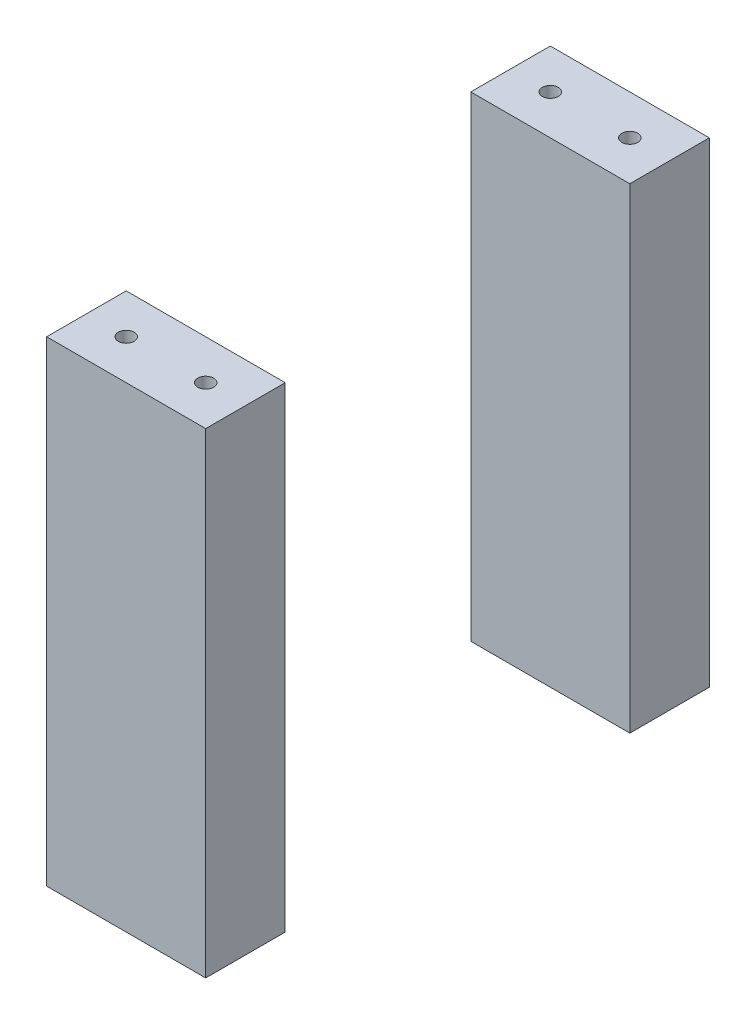
ISO-10303-21;
HEADER;
FILE_DESCRIPTION(('STEP AP214'),'2;1');
FILE_NAME('part.step','',(''),(''),'','','');
FILE_SCHEMA(('AUTOMOTIVE_DESIGN { 1 0 10303 214 1 1 1 1 }'));
ENDSEC;
DATA;
#1=APPLICATION_CONTEXT('core data for automotive mechanical design processes');
#2=APPLICATION_PROTOCOL_DEFINITION('international standard','automotive_design',2000,#1);
#3=PRODUCT_CONTEXT('',#1,'mechanical');
#4=PRODUCT('Part','Part','',(#3));
#5=PRODUCT_RELATED_PRODUCT_CATEGORY('part','',(#4));
#6=PRODUCT_DEFINITION_FORMATION('','',#4);
#7=PRODUCT_DEFINITION_CONTEXT('part definition',#1,'design');
#8=PRODUCT_DEFINITION('design','',#6,#7);
#9=PRODUCT_DEFINITION_SHAPE('','',#8);
#10=(LENGTH_UNIT() NAMED_UNIT(*) SI_UNIT(.MILLI.,.METRE.));
#11=(NAMED_UNIT(*) PLANE_ANGLE_UNIT() SI_UNIT($,.RADIAN.));
#12=(NAMED_UNIT(*) SI_UNIT($,.STERADIAN.) SOLID_ANGLE_UNIT());
#13=UNCERTAINTY_MEASURE_WITH_UNIT(LENGTH_MEASURE(1.E-05),#10,'distance_accuracy_value','');
#14=(GEOMETRIC_REPRESENTATION_CONTEXT(3) GLOBAL_UNCERTAINTY_ASSIGNED_CONTEXT((#13)) GLOBAL_UNIT_ASSIGNED_CONTEXT((#10,
#11,#12)) REPRESENTATION_CONTEXT('',''));
#15=CARTESIAN_POINT('',(0.,0.,0.));
#16=DIRECTION('',(0.,0.,1.));
#17=DIRECTION('',(1.,0.,0.));
#18=AXIS2_PLACEMENT_3D('',#15,#16,#17);
#19=CARTESIAN_POINT('',(0.,163.5,0.));
#20=DIRECTION('',(0.,1.,0.));
#21=DIRECTION('',(0.,0.,1.));
#22=AXIS2_PLACEMENT_3D('',#19,#20,#21);
#23=PLANE('',#22);
#24=CARTESIAN_POINT('',(14.9999999999996,163.5,270.));
#25=DIRECTION('',(0.,1.,0.));
#26=DIRECTION('',(0.,0.,1.));
#27=AXIS2_PLACEMENT_3D('',#24,#25,#26);
#28=CIRCLE('',#27,3.00000000000001);
#29=CARTESIAN_POINT('',(14.9999999999996,163.5,273.));
#30=VERTEX_POINT('',#29);
#31=EDGE_CURVE('E113',#30,#30,#28,.T.);
#32=ORIENTED_EDGE('',*,*,#31,.F.);
#33=EDGE_LOOP('',(#32));
#34=FACE_BOUND('',#33,.T.);
#35=DIRECTION('',(0.,0.,1.));
#36=VECTOR('',#35,1.);
#37=CARTESIAN_POINT('',(-30.0000000000004,163.5,255.));
#38=LINE('',#37,#36);
#39=CARTESIAN_POINT('',(-30.0000000000004,163.5,255.));
#40=VERTEX_POINT('',#39);
#41=CARTESIAN_POINT('',(-30.0000000000004,163.5,285.));
#42=VERTEX_POINT('',#41);
#43=EDGE_CURVE('E97',#40,#42,#38,.T.);
#44=ORIENTED_EDGE('',*,*,#43,.T.);
#45=DIRECTION('',(1.,0.,0.));
#46=VECTOR('',#45,1.);
#47=CARTESIAN_POINT('',(-30.0000000000004,163.5,285.));
#48=LINE('',#47,#46);
#49=CARTESIAN_POINT('',(29.9999999999997,163.5,285.));
#50=VERTEX_POINT('',#49);
#51=EDGE_CURVE('E114',#42,#50,#48,.T.);
#52=ORIENTED_EDGE('',*,*,#51,.T.);
#53=DIRECTION('',(0.,0.,-1.));
#54=VECTOR('',#53,1.);
#55=CARTESIAN_POINT('',(29.9999999999997,163.5,255.));
#56=LINE('',#55,#54);
#57=CARTESIAN_POINT('',(29.9999999999997,163.5,255.));
#58=VERTEX_POINT('',#57);
#59=EDGE_CURVE('E98',#50,#58,#56,.T.);
#60=ORIENTED_EDGE('',*,*,#59,.T.);
#61=DIRECTION('',(-1.,0.,0.));
#62=VECTOR('',#61,1.);
#63=CARTESIAN_POINT('',(-30.0000000000004,163.5,255.));
#64=LINE('',#63,#62);
#65=EDGE_CURVE('E93',#58,#40,#64,.T.);
#66=ORIENTED_EDGE('',*,*,#65,.T.);
#67=EDGE_LOOP('',(#44,#52,#60,#66));
#68=FACE_BOUND('',#67,.T.);
#69=CARTESIAN_POINT('',(-14.9999999999996,163.5,270.));
#70=DIRECTION('',(0.,1.,0.));
#71=DIRECTION('',(0.,0.,1.));
#72=AXIS2_PLACEMENT_3D('',#69,#70,#71);
#73=CIRCLE('',#72,3.00000000000018);
#74=CARTESIAN_POINT('',(-14.9999999999996,163.5,273.));
#75=VERTEX_POINT('',#74);
#76=EDGE_CURVE('E117',#75,#75,#73,.T.);
#77=ORIENTED_EDGE('',*,*,#76,.F.);
#78=EDGE_LOOP('',(#77));
#79=FACE_BOUND('',#78,.T.);
#80=ADVANCED_FACE('F49',(#34,#68,#79),#23,.T.);
#81=CARTESIAN_POINT('',(-30.0000000000004,163.5,255.));
#82=DIRECTION('',(1.,0.,0.));
#83=DIRECTION('',(0.,0.,-1.));
#84=AXIS2_PLACEMENT_3D('',#81,#82,#83);
#85=PLANE('',#84);
#86=DIRECTION('',(0.,-1.,0.));
#87=VECTOR('',#86,1.);
#88=CARTESIAN_POINT('',(-30.0000000000004,163.5,255.));
#89=LINE('',#88,#87);
#90=CARTESIAN_POINT('',(-30.0000000000004,-16.,255.));
#91=VERTEX_POINT('',#90);
#92=EDGE_CURVE('E101',#40,#91,#89,.T.);
#93=ORIENTED_EDGE('',*,*,#92,.T.);
#94=DIRECTION('',(0.,0.,1.));
#95=VECTOR('',#94,1.);
#96=CARTESIAN_POINT('',(-30.0000000000004,-16.,255.));
#97=LINE('',#96,#95);
#98=CARTESIAN_POINT('',(-30.0000000000004,-16.,285.));
#99=VERTEX_POINT('',#98);
#100=EDGE_CURVE('E129',#91,#99,#97,.T.);
#101=ORIENTED_EDGE('',*,*,#100,.T.);
#102=DIRECTION('',(0.,-1.,0.));
#103=VECTOR('',#102,1.);
#104=CARTESIAN_POINT('',(-30.0000000000004,163.5,285.));
#105=LINE('',#104,#103);
#106=EDGE_CURVE('E64',#42,#99,#105,.T.);
#107=ORIENTED_EDGE('',*,*,#106,.F.);
#108=ORIENTED_EDGE('',*,*,#43,.F.);
#109=EDGE_LOOP('',(#93,#101,#107,#108));
#110=FACE_BOUND('',#109,.T.);
#111=ADVANCED_FACE('F112',(#110),#85,.F.);
#112=CARTESIAN_POINT('',(-30.0000000000004,163.5,285.));
#113=DIRECTION('',(0.,0.,-1.));
#114=DIRECTION('',(-1.,0.,0.));
#115=AXIS2_PLACEMENT_3D('',#112,#113,#114);
#116=PLANE('',#115);
#117=ORIENTED_EDGE('',*,*,#106,.T.);
#118=DIRECTION('',(1.,0.,0.));
#119=VECTOR('',#118,1.);
#120=CARTESIAN_POINT('',(-30.0000000000004,-16.,285.));
#121=LINE('',#120,#119);
#122=CARTESIAN_POINT('',(29.9999999999997,-16.,285.));
#123=VERTEX_POINT('',#122);
#124=EDGE_CURVE('E127',#99,#123,#121,.T.);
#125=ORIENTED_EDGE('',*,*,#124,.T.);
#126=DIRECTION('',(0.,-1.,0.));
#127=VECTOR('',#126,1.);
#128=CARTESIAN_POINT('',(29.9999999999997,163.5,285.));
#129=LINE('',#128,#127);
#130=EDGE_CURVE('E72',#50,#123,#129,.T.);
#131=ORIENTED_EDGE('',*,*,#130,.F.);
#132=ORIENTED_EDGE('',*,*,#51,.F.);
#133=EDGE_LOOP('',(#117,#125,#131,#132));
#134=FACE_BOUND('',#133,.T.);
#135=ADVANCED_FACE('F153',(#134),#116,.F.);
#136=CARTESIAN_POINT('',(29.9999999999997,163.5,255.));
#137=DIRECTION('',(-1.,0.,0.));
#138=DIRECTION('',(0.,0.,1.));
#139=AXIS2_PLACEMENT_3D('',#136,#137,#138);
#140=PLANE('',#139);
#141=ORIENTED_EDGE('',*,*,#130,.T.);
#142=DIRECTION('',(0.,0.,-1.));
#143=VECTOR('',#142,1.);
#144=CARTESIAN_POINT('',(29.9999999999997,-16.,255.));
#145=LINE('',#144,#143);
#146=CARTESIAN_POINT('',(29.9999999999997,-16.,255.));
#147=VERTEX_POINT('',#146);
#148=EDGE_CURVE('E125',#123,#147,#145,.T.);
#149=ORIENTED_EDGE('',*,*,#148,.T.);
#150=DIRECTION('',(0.,-1.,0.));
#151=VECTOR('',#150,1.);
#152=CARTESIAN_POINT('',(29.9999999999997,163.5,255.));
#153=LINE('',#152,#151);
#154=EDGE_CURVE('E110',#58,#147,#153,.T.);
#155=ORIENTED_EDGE('',*,*,#154,.F.);
#156=ORIENTED_EDGE('',*,*,#59,.F.);
#157=EDGE_LOOP('',(#141,#149,#155,#156));
#158=FACE_BOUND('',#157,.T.);
#159=ADVANCED_FACE('F145',(#158),#140,.F.);
#160=CARTESIAN_POINT('',(-30.0000000000004,163.5,255.));
#161=DIRECTION('',(0.,0.,1.));
#162=DIRECTION('',(1.,0.,0.));
#163=AXIS2_PLACEMENT_3D('',#160,#161,#162);
#164=PLANE('',#163);
#165=ORIENTED_EDGE('',*,*,#154,.T.);
#166=DIRECTION('',(-1.,0.,0.));
#167=VECTOR('',#166,1.);
#168=CARTESIAN_POINT('',(-30.0000000000004,-16.,255.));
#169=LINE('',#168,#167);
#170=EDGE_CURVE('E106',#147,#91,#169,.T.);
#171=ORIENTED_EDGE('',*,*,#170,.T.);
#172=ORIENTED_EDGE('',*,*,#92,.F.);
#173=ORIENTED_EDGE('',*,*,#65,.F.);
#174=EDGE_LOOP('',(#165,#171,#172,#173));
#175=FACE_BOUND('',#174,.T.);
#176=ADVANCED_FACE('F104',(#175),#164,.F.);
#177=CARTESIAN_POINT('',(14.9999999999996,163.5,270.));
#178=DIRECTION('',(0.,-1.,0.));
#179=DIRECTION('',(0.,0.,-1.));
#180=AXIS2_PLACEMENT_3D('',#177,#178,#179);
#181=CYLINDRICAL_SURFACE('',#180,3.00000000000001);
#182=ORIENTED_EDGE('',*,*,#31,.T.);
#183=EDGE_LOOP('',(#182));
#184=FACE_BOUND('',#183,.T.);
#185=CARTESIAN_POINT('',(14.9999999999996,-16.,270.));
#186=DIRECTION('',(0.,1.,0.));
#187=DIRECTION('',(0.,0.,1.));
#188=AXIS2_PLACEMENT_3D('',#185,#186,#187);
#189=CIRCLE('',#188,3.00000000000001);
#190=CARTESIAN_POINT('',(14.9999999999996,-16.,273.));
#191=VERTEX_POINT('',#190);
#192=EDGE_CURVE('E57',#191,#191,#189,.T.);
#193=ORIENTED_EDGE('',*,*,#192,.F.);
#194=EDGE_LOOP('',(#193));
#195=FACE_BOUND('',#194,.T.);
#196=ADVANCED_FACE('F135',(#184,#195),#181,.F.);
#197=CARTESIAN_POINT('',(-14.9999999999996,163.5,270.));
#198=DIRECTION('',(0.,-1.,0.));
#199=DIRECTION('',(0.,0.,-1.));
#200=AXIS2_PLACEMENT_3D('',#197,#198,#199);
#201=CYLINDRICAL_SURFACE('',#200,3.00000000000018);
#202=ORIENTED_EDGE('',*,*,#76,.T.);
#203=EDGE_LOOP('',(#202));
#204=FACE_BOUND('',#203,.T.);
#205=CARTESIAN_POINT('',(-14.9999999999996,-16.,270.));
#206=DIRECTION('',(0.,1.,0.));
#207=DIRECTION('',(0.,0.,1.));
#208=AXIS2_PLACEMENT_3D('',#205,#206,#207);
#209=CIRCLE('',#208,3.00000000000018);
#210=CARTESIAN_POINT('',(-14.9999999999996,-16.,273.));
#211=VERTEX_POINT('',#210);
#212=EDGE_CURVE('E12',#211,#211,#209,.T.);
#213=ORIENTED_EDGE('',*,*,#212,.F.);
#214=EDGE_LOOP('',(#213));
#215=FACE_BOUND('',#214,.T.);
#216=ADVANCED_FACE('F137',(#204,#215),#201,.F.);
#217=CARTESIAN_POINT('',(0.,-16.,0.));
#218=DIRECTION('',(0.,1.,0.));
#219=DIRECTION('',(0.,0.,1.));
#220=AXIS2_PLACEMENT_3D('',#217,#218,#219);
#221=PLANE('',#220);
#222=ORIENTED_EDGE('',*,*,#212,.T.);
#223=EDGE_LOOP('',(#222));
#224=FACE_BOUND('',#223,.T.);
#225=ORIENTED_EDGE('',*,*,#192,.T.);
#226=EDGE_LOOP('',(#225));
#227=FACE_BOUND('',#226,.T.);
#228=ORIENTED_EDGE('',*,*,#100,.F.);
#229=ORIENTED_EDGE('',*,*,#170,.F.);
#230=ORIENTED_EDGE('',*,*,#148,.F.);
#231=ORIENTED_EDGE('',*,*,#124,.F.);
#232=EDGE_LOOP('',(#228,#229,#230,#231));
#233=FACE_BOUND('',#232,.T.);
#234=ADVANCED_FACE('F51',(#224,#227,#233),#221,.F.);
#235=CLOSED_SHELL('',(#80,#111,#135,#159,#176,#196,#216,#234));
#236=MANIFOLD_SOLID_BREP('B2',#235);
#237=CARTESIAN_POINT('',(0.,163.5,0.));
#238=DIRECTION('',(0.,1.,0.));
#239=DIRECTION('',(0.,0.,1.));
#240=AXIS2_PLACEMENT_3D('',#237,#238,#239);
#241=PLANE('',#240);
#242=CARTESIAN_POINT('',(-15.0000000000004,163.5,110.));
#243=DIRECTION('',(0.,1.,0.));
#244=DIRECTION('',(0.,0.,1.));
#245=AXIS2_PLACEMENT_3D('',#242,#243,#244);
#246=CIRCLE('',#245,3.00000000000001);
#247=CARTESIAN_POINT('',(-15.0000000000004,163.5,113.));
#248=VERTEX_POINT('',#247);
#249=EDGE_CURVE('E287',#248,#248,#246,.T.);
#250=ORIENTED_EDGE('',*,*,#249,.F.);
#251=EDGE_LOOP('',(#250));
#252=FACE_BOUND('',#251,.T.);
#253=DIRECTION('',(0.,0.,1.));
#254=VECTOR('',#253,1.);
#255=CARTESIAN_POINT('',(-30.0000000000003,163.5,95.0000000000001));
#256=LINE('',#255,#254);
#257=CARTESIAN_POINT('',(-30.0000000000003,163.5,95.0000000000001));
#258=VERTEX_POINT('',#257);
#259=CARTESIAN_POINT('',(-30.0000000000003,163.5,125.));
#260=VERTEX_POINT('',#259);
#261=EDGE_CURVE('E290',#258,#260,#256,.T.);
#262=ORIENTED_EDGE('',*,*,#261,.T.);
#263=DIRECTION('',(1.,0.,0.));
#264=VECTOR('',#263,1.);
#265=CARTESIAN_POINT('',(-30.0000000000003,163.5,125.));
#266=LINE('',#265,#264);
#267=CARTESIAN_POINT('',(29.9999999999996,163.5,125.));
#268=VERTEX_POINT('',#267);
#269=EDGE_CURVE('E259',#260,#268,#266,.T.);
#270=ORIENTED_EDGE('',*,*,#269,.T.);
#271=DIRECTION('',(0.,0.,-1.));
#272=VECTOR('',#271,1.);
#273=CARTESIAN_POINT('',(29.9999999999996,163.5,95.0000000000001));
#274=LINE('',#273,#272);
#275=CARTESIAN_POINT('',(29.9999999999996,163.5,95.0000000000001));
#276=VERTEX_POINT('',#275);
#277=EDGE_CURVE('E235',#268,#276,#274,.T.);
#278=ORIENTED_EDGE('',*,*,#277,.T.);
#279=DIRECTION('',(-1.,0.,0.));
#280=VECTOR('',#279,1.);
#281=CARTESIAN_POINT('',(-30.0000000000003,163.5,95.0000000000001));
#282=LINE('',#281,#280);
#283=EDGE_CURVE('E230',#276,#258,#282,.T.);
#284=ORIENTED_EDGE('',*,*,#283,.T.);
#285=EDGE_LOOP('',(#262,#270,#278,#284));
#286=FACE_BOUND('',#285,.T.);
#287=CARTESIAN_POINT('',(15.0000000000004,163.5,110.));
#288=DIRECTION('',(0.,1.,0.));
#289=DIRECTION('',(0.,0.,1.));
#290=AXIS2_PLACEMENT_3D('',#287,#288,#289);
#291=CIRCLE('',#290,3.00000000000023);
#292=CARTESIAN_POINT('',(15.0000000000004,163.5,113.));
#293=VERTEX_POINT('',#292);
#294=EDGE_CURVE('E284',#293,#293,#291,.T.);
#295=ORIENTED_EDGE('',*,*,#294,.F.);
#296=EDGE_LOOP('',(#295));
#297=FACE_BOUND('',#296,.T.);
#298=ADVANCED_FACE('F215',(#252,#286,#297),#241,.T.);
#299=CARTESIAN_POINT('',(-30.0000000000003,163.5,95.0000000000001));
#300=DIRECTION('',(1.,0.,0.));
#301=DIRECTION('',(0.,0.,-1.));
#302=AXIS2_PLACEMENT_3D('',#299,#300,#301);
#303=PLANE('',#302);
#304=DIRECTION('',(0.,-1.,0.));
#305=VECTOR('',#304,1.);
#306=CARTESIAN_POINT('',(-30.0000000000003,163.5,95.0000000000001));
#307=LINE('',#306,#305);
#308=CARTESIAN_POINT('',(-30.0000000000003,-16.,95.0000000000001));
#309=VERTEX_POINT('',#308);
#310=EDGE_CURVE('E273',#258,#309,#307,.T.);
#311=ORIENTED_EDGE('',*,*,#310,.T.);
#312=DIRECTION('',(0.,0.,1.));
#313=VECTOR('',#312,1.);
#314=CARTESIAN_POINT('',(-30.0000000000003,-16.,95.0000000000001));
#315=LINE('',#314,#313);
#316=CARTESIAN_POINT('',(-30.0000000000003,-16.,125.));
#317=VERTEX_POINT('',#316);
#318=EDGE_CURVE('E268',#309,#317,#315,.T.);
#319=ORIENTED_EDGE('',*,*,#318,.T.);
#320=DIRECTION('',(0.,-1.,0.));
#321=VECTOR('',#320,1.);
#322=CARTESIAN_POINT('',(-30.0000000000003,163.5,125.));
#323=LINE('',#322,#321);
#324=EDGE_CURVE('E47',#260,#317,#323,.T.);
#325=ORIENTED_EDGE('',*,*,#324,.F.);
#326=ORIENTED_EDGE('',*,*,#261,.F.);
#327=EDGE_LOOP('',(#311,#319,#325,#326));
#328=FACE_BOUND('',#327,.T.);
#329=ADVANCED_FACE('F217',(#328),#303,.F.);
#330=CARTESIAN_POINT('',(-30.0000000000003,163.5,125.));
#331=DIRECTION('',(0.,0.,-1.));
#332=DIRECTION('',(-1.,0.,0.));
#333=AXIS2_PLACEMENT_3D('',#330,#331,#332);
#334=PLANE('',#333);
#335=ORIENTED_EDGE('',*,*,#324,.T.);
#336=DIRECTION('',(1.,0.,0.));
#337=VECTOR('',#336,1.);
#338=CARTESIAN_POINT('',(-30.0000000000003,-16.,125.));
#339=LINE('',#338,#337);
#340=CARTESIAN_POINT('',(29.9999999999996,-16.,125.));
#341=VERTEX_POINT('',#340);
#342=EDGE_CURVE('E258',#317,#341,#339,.T.);
#343=ORIENTED_EDGE('',*,*,#342,.T.);
#344=DIRECTION('',(0.,-1.,0.));
#345=VECTOR('',#344,1.);
#346=CARTESIAN_POINT('',(29.9999999999996,163.5,125.));
#347=LINE('',#346,#345);
#348=EDGE_CURVE('E223',#268,#341,#347,.T.);
#349=ORIENTED_EDGE('',*,*,#348,.F.);
#350=ORIENTED_EDGE('',*,*,#269,.F.);
#351=EDGE_LOOP('',(#335,#343,#349,#350));
#352=FACE_BOUND('',#351,.T.);
#353=ADVANCED_FACE('F256',(#352),#334,.F.);
#354=CARTESIAN_POINT('',(29.9999999999996,163.5,95.0000000000001));
#355=DIRECTION('',(-1.,0.,0.));
#356=DIRECTION('',(0.,0.,1.));
#357=AXIS2_PLACEMENT_3D('',#354,#355,#356);
#358=PLANE('',#357);
#359=ORIENTED_EDGE('',*,*,#348,.T.);
#360=DIRECTION('',(0.,0.,-1.));
#361=VECTOR('',#360,1.);
#362=CARTESIAN_POINT('',(29.9999999999996,-16.,95.0000000000001));
#363=LINE('',#362,#361);
#364=CARTESIAN_POINT('',(29.9999999999996,-16.,95.0000000000001));
#365=VERTEX_POINT('',#364);
#366=EDGE_CURVE('E271',#341,#365,#363,.T.);
#367=ORIENTED_EDGE('',*,*,#366,.T.);
#368=DIRECTION('',(0.,-1.,0.));
#369=VECTOR('',#368,1.);
#370=CARTESIAN_POINT('',(29.9999999999996,163.5,95.0000000000001));
#371=LINE('',#370,#369);
#372=EDGE_CURVE('E296',#276,#365,#371,.T.);
#373=ORIENTED_EDGE('',*,*,#372,.F.);
#374=ORIENTED_EDGE('',*,*,#277,.F.);
#375=EDGE_LOOP('',(#359,#367,#373,#374));
#376=FACE_BOUND('',#375,.T.);
#377=ADVANCED_FACE('F298',(#376),#358,.F.);
#378=CARTESIAN_POINT('',(-30.0000000000003,163.5,95.0000000000001));
#379=DIRECTION('',(0.,0.,1.));
#380=DIRECTION('',(1.,0.,0.));
#381=AXIS2_PLACEMENT_3D('',#378,#379,#380);
#382=PLANE('',#381);
#383=ORIENTED_EDGE('',*,*,#372,.T.);
#384=DIRECTION('',(-1.,0.,0.));
#385=VECTOR('',#384,1.);
#386=CARTESIAN_POINT('',(-30.0000000000003,-16.,95.0000000000001));
#387=LINE('',#386,#385);
#388=EDGE_CURVE('E282',#365,#309,#387,.T.);
#389=ORIENTED_EDGE('',*,*,#388,.T.);
#390=ORIENTED_EDGE('',*,*,#310,.F.);
#391=ORIENTED_EDGE('',*,*,#283,.F.);
#392=EDGE_LOOP('',(#383,#389,#390,#391));
#393=FACE_BOUND('',#392,.T.);
#394=ADVANCED_FACE('F300',(#393),#382,.F.);
#395=CARTESIAN_POINT('',(-15.0000000000004,163.5,110.));
#396=DIRECTION('',(0.,-1.,0.));
#397=DIRECTION('',(0.,0.,-1.));
#398=AXIS2_PLACEMENT_3D('',#395,#396,#397);
#399=CYLINDRICAL_SURFACE('',#398,3.00000000000001);
#400=ORIENTED_EDGE('',*,*,#249,.T.);
#401=EDGE_LOOP('',(#400));
#402=FACE_BOUND('',#401,.T.);
#403=CARTESIAN_POINT('',(-15.0000000000004,-16.,110.));
#404=DIRECTION('',(0.,1.,0.));
#405=DIRECTION('',(0.,0.,1.));
#406=AXIS2_PLACEMENT_3D('',#403,#404,#405);
#407=CIRCLE('',#406,3.00000000000001);
#408=CARTESIAN_POINT('',(-15.0000000000004,-16.,113.));
#409=VERTEX_POINT('',#408);
#410=EDGE_CURVE('E274',#409,#409,#407,.T.);
#411=ORIENTED_EDGE('',*,*,#410,.F.);
#412=EDGE_LOOP('',(#411));
#413=FACE_BOUND('',#412,.T.);
#414=ADVANCED_FACE('F310',(#402,#413),#399,.F.);
#415=CARTESIAN_POINT('',(15.0000000000004,163.5,110.));
#416=DIRECTION('',(0.,-1.,0.));
#417=DIRECTION('',(0.,0.,-1.));
#418=AXIS2_PLACEMENT_3D('',#415,#416,#417);
#419=CYLINDRICAL_SURFACE('',#418,3.00000000000023);
#420=ORIENTED_EDGE('',*,*,#294,.T.);
#421=EDGE_LOOP('',(#420));
#422=FACE_BOUND('',#421,.T.);
#423=CARTESIAN_POINT('',(15.0000000000004,-16.,110.));
#424=DIRECTION('',(0.,1.,0.));
#425=DIRECTION('',(0.,0.,1.));
#426=AXIS2_PLACEMENT_3D('',#423,#424,#425);
#427=CIRCLE('',#426,3.00000000000023);
#428=CARTESIAN_POINT('',(15.0000000000004,-16.,113.));
#429=VERTEX_POINT('',#428);
#430=EDGE_CURVE('E277',#429,#429,#427,.T.);
#431=ORIENTED_EDGE('',*,*,#430,.F.);
#432=EDGE_LOOP('',(#431));
#433=FACE_BOUND('',#432,.T.);
#434=ADVANCED_FACE('F307',(#422,#433),#419,.F.);
#435=CARTESIAN_POINT('',(0.,-16.,0.));
#436=DIRECTION('',(0.,1.,0.));
#437=DIRECTION('',(0.,0.,1.));
#438=AXIS2_PLACEMENT_3D('',#435,#436,#437);
#439=PLANE('',#438);
#440=ORIENTED_EDGE('',*,*,#430,.T.);
#441=EDGE_LOOP('',(#440));
#442=FACE_BOUND('',#441,.T.);
#443=ORIENTED_EDGE('',*,*,#410,.T.);
#444=EDGE_LOOP('',(#443));
#445=FACE_BOUND('',#444,.T.);
#446=ORIENTED_EDGE('',*,*,#318,.F.);
#447=ORIENTED_EDGE('',*,*,#388,.F.);
#448=ORIENTED_EDGE('',*,*,#366,.F.);
#449=ORIENTED_EDGE('',*,*,#342,.F.);
#450=EDGE_LOOP('',(#446,#447,#448,#449));
#451=FACE_BOUND('',#450,.T.);
#452=ADVANCED_FACE('F266',(#442,#445,#451),#439,.F.);
#453=CLOSED_SHELL('',(#298,#329,#353,#377,#394,#414,#434,#452));
#454=MANIFOLD_SOLID_BREP('B6',#453);
#455=ADVANCED_BREP_SHAPE_REPRESENTATION('',(#18,#236,#454),#14);
#456=SHAPE_DEFINITION_REPRESENTATION(#9,#455);
ENDSEC;
END-ISO-10303-21;
